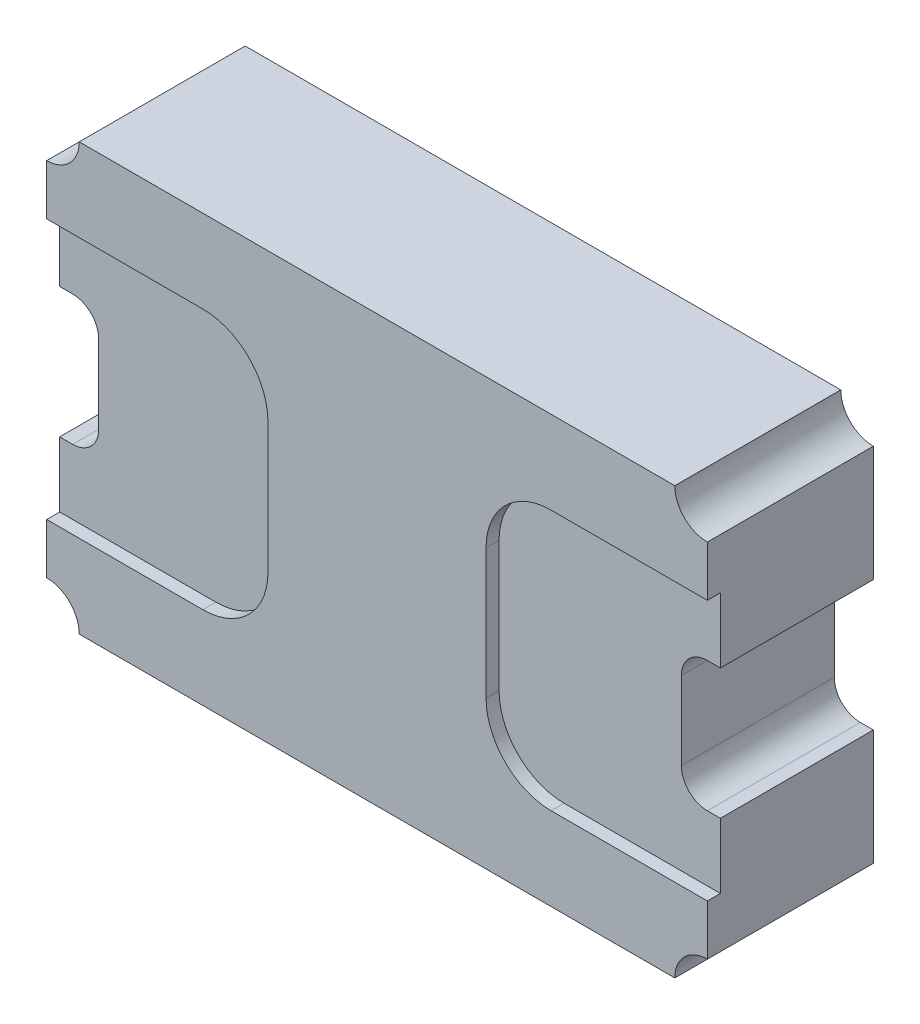
ISO-10303-21;
HEADER;
FILE_DESCRIPTION(('STEP AP214'),'2;1');
FILE_NAME('part.step','',(''),(''),'','','');
FILE_SCHEMA(('AUTOMOTIVE_DESIGN { 1 0 10303 214 1 1 1 1 }'));
ENDSEC;
DATA;
#1=APPLICATION_CONTEXT('core data for automotive mechanical design processes');
#2=APPLICATION_PROTOCOL_DEFINITION('international standard','automotive_design',2000,#1);
#3=PRODUCT_CONTEXT('',#1,'mechanical');
#4=PRODUCT('Part','Part','',(#3));
#5=PRODUCT_RELATED_PRODUCT_CATEGORY('part','',(#4));
#6=PRODUCT_DEFINITION_FORMATION('','',#4);
#7=PRODUCT_DEFINITION_CONTEXT('part definition',#1,'design');
#8=PRODUCT_DEFINITION('design','',#6,#7);
#9=PRODUCT_DEFINITION_SHAPE('','',#8);
#10=(LENGTH_UNIT() NAMED_UNIT(*) SI_UNIT(.MILLI.,.METRE.));
#11=(NAMED_UNIT(*) PLANE_ANGLE_UNIT() SI_UNIT($,.RADIAN.));
#12=(NAMED_UNIT(*) SI_UNIT($,.STERADIAN.) SOLID_ANGLE_UNIT());
#13=UNCERTAINTY_MEASURE_WITH_UNIT(LENGTH_MEASURE(1.E-05),#10,'distance_accuracy_value','');
#14=(GEOMETRIC_REPRESENTATION_CONTEXT(3) GLOBAL_UNCERTAINTY_ASSIGNED_CONTEXT((#13)) GLOBAL_UNIT_ASSIGNED_CONTEXT((#10,
#11,#12)) REPRESENTATION_CONTEXT('',''));
#15=CARTESIAN_POINT('',(0.,0.,0.));
#16=DIRECTION('',(0.,0.,1.));
#17=DIRECTION('',(1.,0.,0.));
#18=AXIS2_PLACEMENT_3D('',#15,#16,#17);
#19=CARTESIAN_POINT('',(2.5375,1.6375,1.275));
#20=DIRECTION('',(-1.,0.,0.));
#21=DIRECTION('',(0.,-1.,0.));
#22=AXIS2_PLACEMENT_3D('',#19,#20,#21);
#23=PLANE('',#22);
#24=DIRECTION('',(0.,1.,0.));
#25=VECTOR('',#24,1.);
#26=CARTESIAN_POINT('',(2.5375,1.6375,0.));
#27=LINE('',#26,#25);
#28=CARTESIAN_POINT('',(2.5375,0.499999999999999,0.));
#29=VERTEX_POINT('',#28);
#30=CARTESIAN_POINT('',(2.5375,1.3875,0.));
#31=VERTEX_POINT('',#30);
#32=EDGE_CURVE('E295',#29,#31,#27,.T.);
#33=ORIENTED_EDGE('',*,*,#32,.T.);
#34=DIRECTION('',(0.,0.,-1.));
#35=VECTOR('',#34,1.);
#36=CARTESIAN_POINT('',(2.5375,1.3875,1.7));
#37=LINE('',#36,#35);
#38=CARTESIAN_POINT('',(2.5375,1.3875,1.275));
#39=VERTEX_POINT('',#38);
#40=EDGE_CURVE('E259',#31,#39,#37,.F.);
#41=ORIENTED_EDGE('',*,*,#40,.T.);
#42=DIRECTION('',(0.,1.,0.));
#43=VECTOR('',#42,1.);
#44=CARTESIAN_POINT('',(2.5375,1.6375,1.275));
#45=LINE('',#44,#43);
#46=CARTESIAN_POINT('',(2.5375,1.,1.275));
#47=VERTEX_POINT('',#46);
#48=EDGE_CURVE('E304',#47,#39,#45,.T.);
#49=ORIENTED_EDGE('',*,*,#48,.F.);
#50=DIRECTION('',(0.,0.,1.));
#51=VECTOR('',#50,1.);
#52=CARTESIAN_POINT('',(2.5375,1.,1.275));
#53=LINE('',#52,#51);
#54=CARTESIAN_POINT('',(2.5375,1.,1.175));
#55=VERTEX_POINT('',#54);
#56=EDGE_CURVE('E579',#55,#47,#53,.T.);
#57=ORIENTED_EDGE('',*,*,#56,.F.);
#58=DIRECTION('',(0.,1.,0.));
#59=VECTOR('',#58,1.);
#60=CARTESIAN_POINT('',(2.5375,1.,1.175));
#61=LINE('',#60,#59);
#62=CARTESIAN_POINT('',(2.5375,0.499999999999999,1.175));
#63=VERTEX_POINT('',#62);
#64=EDGE_CURVE('E583',#63,#55,#61,.T.);
#65=ORIENTED_EDGE('',*,*,#64,.F.);
#66=DIRECTION('',(0.,0.,-1.));
#67=VECTOR('',#66,1.);
#68=CARTESIAN_POINT('',(2.5375,0.499999999999999,1.7));
#69=LINE('',#68,#67);
#70=EDGE_CURVE('E473',#63,#29,#69,.T.);
#71=ORIENTED_EDGE('',*,*,#70,.T.);
#72=EDGE_LOOP('',(#33,#41,#49,#57,#65,#71));
#73=FACE_BOUND('',#72,.T.);
#74=ADVANCED_FACE('F45',(#73),#23,.F.);
#75=CARTESIAN_POINT('',(-2.5375,1.6375,1.275));
#76=DIRECTION('',(1.,0.,0.));
#77=DIRECTION('',(0.,1.,0.));
#78=AXIS2_PLACEMENT_3D('',#75,#76,#77);
#79=PLANE('',#78);
#80=DIRECTION('',(0.,-1.,0.));
#81=VECTOR('',#80,1.);
#82=CARTESIAN_POINT('',(-2.5375,1.6375,1.275));
#83=LINE('',#82,#81);
#84=CARTESIAN_POINT('',(-2.5375,1.3875,1.275));
#85=VERTEX_POINT('',#84);
#86=CARTESIAN_POINT('',(-2.5375,1.,1.275));
#87=VERTEX_POINT('',#86);
#88=EDGE_CURVE('E434',#85,#87,#83,.T.);
#89=ORIENTED_EDGE('',*,*,#88,.F.);
#90=DIRECTION('',(0.,0.,-1.));
#91=VECTOR('',#90,1.);
#92=CARTESIAN_POINT('',(-2.5375,1.3875,1.7));
#93=LINE('',#92,#91);
#94=CARTESIAN_POINT('',(-2.5375,1.3875,0.));
#95=VERTEX_POINT('',#94);
#96=EDGE_CURVE('E625',#85,#95,#93,.T.);
#97=ORIENTED_EDGE('',*,*,#96,.T.);
#98=DIRECTION('',(0.,-1.,0.));
#99=VECTOR('',#98,1.);
#100=CARTESIAN_POINT('',(-2.5375,1.6375,0.));
#101=LINE('',#100,#99);
#102=CARTESIAN_POINT('',(-2.5375,0.5,0.));
#103=VERTEX_POINT('',#102);
#104=EDGE_CURVE('E292',#95,#103,#101,.T.);
#105=ORIENTED_EDGE('',*,*,#104,.T.);
#106=DIRECTION('',(0.,0.,-1.));
#107=VECTOR('',#106,1.);
#108=CARTESIAN_POINT('',(-2.5375,0.5,1.7));
#109=LINE('',#108,#107);
#110=CARTESIAN_POINT('',(-2.5375,0.5,1.175));
#111=VERTEX_POINT('',#110);
#112=EDGE_CURVE('E499',#111,#103,#109,.T.);
#113=ORIENTED_EDGE('',*,*,#112,.F.);
#114=DIRECTION('',(0.,-1.,0.));
#115=VECTOR('',#114,1.);
#116=CARTESIAN_POINT('',(-2.5375,1.,1.175));
#117=LINE('',#116,#115);
#118=CARTESIAN_POINT('',(-2.5375,1.,1.175));
#119=VERTEX_POINT('',#118);
#120=EDGE_CURVE('E560',#119,#111,#117,.T.);
#121=ORIENTED_EDGE('',*,*,#120,.F.);
#122=DIRECTION('',(0.,0.,-1.));
#123=VECTOR('',#122,1.);
#124=CARTESIAN_POINT('',(-2.5375,1.,1.275));
#125=LINE('',#124,#123);
#126=EDGE_CURVE('E492',#87,#119,#125,.T.);
#127=ORIENTED_EDGE('',*,*,#126,.F.);
#128=EDGE_LOOP('',(#89,#97,#105,#113,#121,#127));
#129=FACE_BOUND('',#128,.T.);
#130=ADVANCED_FACE('F712',(#129),#79,.F.);
#131=CARTESIAN_POINT('',(2.5375,-1.3875,1.275));
#132=VERTEX_POINT('',#131);
#133=CARTESIAN_POINT('',(2.5375,-1.,1.275));
#134=VERTEX_POINT('',#133);
#135=EDGE_CURVE('E428',#132,#134,#45,.T.);
#136=ORIENTED_EDGE('',*,*,#135,.F.);
#137=DIRECTION('',(0.,0.,-1.));
#138=VECTOR('',#137,1.);
#139=CARTESIAN_POINT('',(2.5375,-1.3875,1.7));
#140=LINE('',#139,#138);
#141=CARTESIAN_POINT('',(2.5375,-1.3875,0.));
#142=VERTEX_POINT('',#141);
#143=EDGE_CURVE('E457',#132,#142,#140,.T.);
#144=ORIENTED_EDGE('',*,*,#143,.T.);
#145=CARTESIAN_POINT('',(2.5375,-0.5,0.));
#146=VERTEX_POINT('',#145);
#147=EDGE_CURVE('E286',#142,#146,#27,.T.);
#148=ORIENTED_EDGE('',*,*,#147,.T.);
#149=DIRECTION('',(0.,0.,-1.));
#150=VECTOR('',#149,1.);
#151=CARTESIAN_POINT('',(2.5375,-0.5,1.7));
#152=LINE('',#151,#150);
#153=CARTESIAN_POINT('',(2.5375,-0.5,1.175));
#154=VERTEX_POINT('',#153);
#155=EDGE_CURVE('E527',#154,#146,#152,.T.);
#156=ORIENTED_EDGE('',*,*,#155,.F.);
#157=CARTESIAN_POINT('',(2.5375,-1.,1.175));
#158=VERTEX_POINT('',#157);
#159=EDGE_CURVE('E584',#158,#154,#61,.T.);
#160=ORIENTED_EDGE('',*,*,#159,.F.);
#161=DIRECTION('',(0.,0.,-1.));
#162=VECTOR('',#161,1.);
#163=CARTESIAN_POINT('',(2.5375,-1.,1.175));
#164=LINE('',#163,#162);
#165=EDGE_CURVE('E416',#134,#158,#164,.T.);
#166=ORIENTED_EDGE('',*,*,#165,.F.);
#167=EDGE_LOOP('',(#136,#144,#148,#156,#160,#166));
#168=FACE_BOUND('',#167,.T.);
#169=ADVANCED_FACE('F747',(#168),#23,.F.);
#170=CARTESIAN_POINT('',(-2.5375,1.6375,1.275));
#171=DIRECTION('',(0.,-1.,0.));
#172=DIRECTION('',(1.,0.,0.));
#173=AXIS2_PLACEMENT_3D('',#170,#171,#172);
#174=PLANE('',#173);
#175=DIRECTION('',(-1.,0.,0.));
#176=VECTOR('',#175,1.);
#177=CARTESIAN_POINT('',(-2.5375,1.6375,0.));
#178=LINE('',#177,#176);
#179=CARTESIAN_POINT('',(2.2875,1.6375,0.));
#180=VERTEX_POINT('',#179);
#181=CARTESIAN_POINT('',(-2.2875,1.6375,0.));
#182=VERTEX_POINT('',#181);
#183=EDGE_CURVE('E273',#180,#182,#178,.T.);
#184=ORIENTED_EDGE('',*,*,#183,.T.);
#185=DIRECTION('',(0.,0.,-1.));
#186=VECTOR('',#185,1.);
#187=CARTESIAN_POINT('',(-2.2875,1.6375,1.7));
#188=LINE('',#187,#186);
#189=CARTESIAN_POINT('',(-2.2875,1.6375,1.275));
#190=VERTEX_POINT('',#189);
#191=EDGE_CURVE('E631',#182,#190,#188,.F.);
#192=ORIENTED_EDGE('',*,*,#191,.T.);
#193=DIRECTION('',(-1.,0.,0.));
#194=VECTOR('',#193,1.);
#195=CARTESIAN_POINT('',(-2.5375,1.6375,1.275));
#196=LINE('',#195,#194);
#197=CARTESIAN_POINT('',(2.2875,1.6375,1.275));
#198=VERTEX_POINT('',#197);
#199=EDGE_CURVE('E275',#198,#190,#196,.T.);
#200=ORIENTED_EDGE('',*,*,#199,.F.);
#201=DIRECTION('',(0.,0.,-1.));
#202=VECTOR('',#201,1.);
#203=CARTESIAN_POINT('',(2.2875,1.6375,1.7));
#204=LINE('',#203,#202);
#205=EDGE_CURVE('E256',#198,#180,#204,.T.);
#206=ORIENTED_EDGE('',*,*,#205,.T.);
#207=EDGE_LOOP('',(#184,#192,#200,#206));
#208=FACE_BOUND('',#207,.T.);
#209=ADVANCED_FACE('F271',(#208),#174,.F.);
#210=CARTESIAN_POINT('',(-2.5375,-0.5,0.));
#211=VERTEX_POINT('',#210);
#212=CARTESIAN_POINT('',(-2.5375,-1.3875,0.));
#213=VERTEX_POINT('',#212);
#214=EDGE_CURVE('E285',#211,#213,#101,.T.);
#215=ORIENTED_EDGE('',*,*,#214,.T.);
#216=DIRECTION('',(0.,0.,-1.));
#217=VECTOR('',#216,1.);
#218=CARTESIAN_POINT('',(-2.5375,-1.3875,1.7));
#219=LINE('',#218,#217);
#220=CARTESIAN_POINT('',(-2.5375,-1.3875,1.275));
#221=VERTEX_POINT('',#220);
#222=EDGE_CURVE('E465',#213,#221,#219,.F.);
#223=ORIENTED_EDGE('',*,*,#222,.T.);
#224=CARTESIAN_POINT('',(-2.5375,-1.,1.275));
#225=VERTEX_POINT('',#224);
#226=EDGE_CURVE('E433',#225,#221,#83,.T.);
#227=ORIENTED_EDGE('',*,*,#226,.F.);
#228=DIRECTION('',(0.,0.,1.));
#229=VECTOR('',#228,1.);
#230=CARTESIAN_POINT('',(-2.5375,-1.,1.175));
#231=LINE('',#230,#229);
#232=CARTESIAN_POINT('',(-2.5375,-1.,1.175));
#233=VERTEX_POINT('',#232);
#234=EDGE_CURVE('E551',#233,#225,#231,.T.);
#235=ORIENTED_EDGE('',*,*,#234,.F.);
#236=CARTESIAN_POINT('',(-2.5375,-0.5,1.175));
#237=VERTEX_POINT('',#236);
#238=EDGE_CURVE('E559',#237,#233,#117,.T.);
#239=ORIENTED_EDGE('',*,*,#238,.F.);
#240=DIRECTION('',(0.,0.,-1.));
#241=VECTOR('',#240,1.);
#242=CARTESIAN_POINT('',(-2.5375,-0.5,1.7));
#243=LINE('',#242,#241);
#244=EDGE_CURVE('E503',#237,#211,#243,.T.);
#245=ORIENTED_EDGE('',*,*,#244,.T.);
#246=EDGE_LOOP('',(#215,#223,#227,#235,#239,#245));
#247=FACE_BOUND('',#246,.T.);
#248=ADVANCED_FACE('F752',(#247),#79,.F.);
#249=CARTESIAN_POINT('',(-2.5375,-1.6375,1.275));
#250=DIRECTION('',(0.,1.,0.));
#251=DIRECTION('',(0.,0.,1.));
#252=AXIS2_PLACEMENT_3D('',#249,#250,#251);
#253=PLANE('',#252);
#254=DIRECTION('',(1.,0.,0.));
#255=VECTOR('',#254,1.);
#256=CARTESIAN_POINT('',(-2.5375,-1.6375,0.));
#257=LINE('',#256,#255);
#258=CARTESIAN_POINT('',(-2.2875,-1.6375,0.));
#259=VERTEX_POINT('',#258);
#260=CARTESIAN_POINT('',(2.2875,-1.6375,0.));
#261=VERTEX_POINT('',#260);
#262=EDGE_CURVE('E300',#259,#261,#257,.T.);
#263=ORIENTED_EDGE('',*,*,#262,.T.);
#264=DIRECTION('',(0.,0.,-1.));
#265=VECTOR('',#264,1.);
#266=CARTESIAN_POINT('',(2.2875,-1.6375,1.7));
#267=LINE('',#266,#265);
#268=CARTESIAN_POINT('',(2.2875,-1.6375,1.275));
#269=VERTEX_POINT('',#268);
#270=EDGE_CURVE('E453',#261,#269,#267,.F.);
#271=ORIENTED_EDGE('',*,*,#270,.T.);
#272=DIRECTION('',(1.,0.,0.));
#273=VECTOR('',#272,1.);
#274=CARTESIAN_POINT('',(-2.5375,-1.6375,1.275));
#275=LINE('',#274,#273);
#276=CARTESIAN_POINT('',(-2.2875,-1.6375,1.275));
#277=VERTEX_POINT('',#276);
#278=EDGE_CURVE('E310',#277,#269,#275,.T.);
#279=ORIENTED_EDGE('',*,*,#278,.F.);
#280=DIRECTION('',(0.,0.,-1.));
#281=VECTOR('',#280,1.);
#282=CARTESIAN_POINT('',(-2.2875,-1.6375,1.7));
#283=LINE('',#282,#281);
#284=EDGE_CURVE('E451',#277,#259,#283,.T.);
#285=ORIENTED_EDGE('',*,*,#284,.T.);
#286=EDGE_LOOP('',(#263,#271,#279,#285));
#287=FACE_BOUND('',#286,.T.);
#288=ADVANCED_FACE('F450',(#287),#253,.F.);
#289=CARTESIAN_POINT('',(0.,0.,1.275));
#290=DIRECTION('',(0.,0.,1.));
#291=DIRECTION('',(1.,0.,0.));
#292=AXIS2_PLACEMENT_3D('',#289,#290,#291);
#293=PLANE('',#292);
#294=CARTESIAN_POINT('',(2.5375,-1.6375,1.275));
#295=DIRECTION('',(0.,0.,1.));
#296=DIRECTION('',(1.,0.,0.));
#297=AXIS2_PLACEMENT_3D('',#294,#295,#296);
#298=CIRCLE('',#297,0.25);
#299=EDGE_CURVE('E443',#132,#269,#298,.T.);
#300=ORIENTED_EDGE('',*,*,#299,.F.);
#301=ORIENTED_EDGE('',*,*,#135,.T.);
#302=DIRECTION('',(1.,0.,0.));
#303=VECTOR('',#302,1.);
#304=CARTESIAN_POINT('',(0.837500000000001,-1.,1.275));
#305=LINE('',#304,#303);
#306=CARTESIAN_POINT('',(1.3375,-1.,1.275));
#307=VERTEX_POINT('',#306);
#308=EDGE_CURVE('E397',#307,#134,#305,.T.);
#309=ORIENTED_EDGE('',*,*,#308,.F.);
#310=CARTESIAN_POINT('',(1.3375,-0.5,1.275));
#311=DIRECTION('',(0.,0.,1.));
#312=DIRECTION('',(1.,0.,0.));
#313=AXIS2_PLACEMENT_3D('',#310,#311,#312);
#314=CIRCLE('',#313,0.5);
#315=CARTESIAN_POINT('',(0.837500000000001,-0.5,1.275));
#316=VERTEX_POINT('',#315);
#317=EDGE_CURVE('E54',#307,#316,#314,.F.);
#318=ORIENTED_EDGE('',*,*,#317,.T.);
#319=DIRECTION('',(0.,-1.,0.));
#320=VECTOR('',#319,1.);
#321=CARTESIAN_POINT('',(0.837500000000001,1.,1.275));
#322=LINE('',#321,#320);
#323=CARTESIAN_POINT('',(0.837500000000001,0.5,1.275));
#324=VERTEX_POINT('',#323);
#325=EDGE_CURVE('E395',#324,#316,#322,.T.);
#326=ORIENTED_EDGE('',*,*,#325,.F.);
#327=CARTESIAN_POINT('',(1.3375,0.5,1.275));
#328=DIRECTION('',(0.,0.,1.));
#329=DIRECTION('',(1.,0.,0.));
#330=AXIS2_PLACEMENT_3D('',#327,#328,#329);
#331=CIRCLE('',#330,0.5);
#332=CARTESIAN_POINT('',(1.3375,1.,1.275));
#333=VERTEX_POINT('',#332);
#334=EDGE_CURVE('E11',#324,#333,#331,.F.);
#335=ORIENTED_EDGE('',*,*,#334,.T.);
#336=DIRECTION('',(1.,0.,0.));
#337=VECTOR('',#336,1.);
#338=CARTESIAN_POINT('',(0.837500000000001,1.,1.275));
#339=LINE('',#338,#337);
#340=EDGE_CURVE('E424',#333,#47,#339,.T.);
#341=ORIENTED_EDGE('',*,*,#340,.T.);
#342=ORIENTED_EDGE('',*,*,#48,.T.);
#343=CARTESIAN_POINT('',(2.5375,1.6375,1.275));
#344=DIRECTION('',(0.,0.,1.));
#345=DIRECTION('',(1.,0.,0.));
#346=AXIS2_PLACEMENT_3D('',#343,#344,#345);
#347=CIRCLE('',#346,0.25);
#348=EDGE_CURVE('E277',#198,#39,#347,.T.);
#349=ORIENTED_EDGE('',*,*,#348,.F.);
#350=ORIENTED_EDGE('',*,*,#199,.T.);
#351=CARTESIAN_POINT('',(-2.5375,1.6375,1.275));
#352=DIRECTION('',(0.,0.,1.));
#353=DIRECTION('',(1.,0.,0.));
#354=AXIS2_PLACEMENT_3D('',#351,#352,#353);
#355=CIRCLE('',#354,0.25);
#356=EDGE_CURVE('E629',#85,#190,#355,.T.);
#357=ORIENTED_EDGE('',*,*,#356,.F.);
#358=ORIENTED_EDGE('',*,*,#88,.T.);
#359=DIRECTION('',(-1.,0.,0.));
#360=VECTOR('',#359,1.);
#361=CARTESIAN_POINT('',(-0.8375,1.,1.275));
#362=LINE('',#361,#360);
#363=CARTESIAN_POINT('',(-1.3375,1.,1.275));
#364=VERTEX_POINT('',#363);
#365=EDGE_CURVE('E567',#364,#87,#362,.T.);
#366=ORIENTED_EDGE('',*,*,#365,.F.);
#367=CARTESIAN_POINT('',(-1.3375,0.5,1.275));
#368=DIRECTION('',(0.,0.,1.));
#369=DIRECTION('',(1.,0.,0.));
#370=AXIS2_PLACEMENT_3D('',#367,#368,#369);
#371=CIRCLE('',#370,0.5);
#372=CARTESIAN_POINT('',(-0.8375,0.5,1.275));
#373=VERTEX_POINT('',#372);
#374=EDGE_CURVE('E383',#364,#373,#371,.F.);
#375=ORIENTED_EDGE('',*,*,#374,.T.);
#376=DIRECTION('',(0.,1.,0.));
#377=VECTOR('',#376,1.);
#378=CARTESIAN_POINT('',(-0.8375,-1.,1.275));
#379=LINE('',#378,#377);
#380=CARTESIAN_POINT('',(-0.8375,-0.5,1.275));
#381=VERTEX_POINT('',#380);
#382=EDGE_CURVE('E550',#381,#373,#379,.T.);
#383=ORIENTED_EDGE('',*,*,#382,.F.);
#384=CARTESIAN_POINT('',(-1.3375,-0.5,1.275));
#385=DIRECTION('',(0.,0.,1.));
#386=DIRECTION('',(1.,0.,0.));
#387=AXIS2_PLACEMENT_3D('',#384,#385,#386);
#388=CIRCLE('',#387,0.5);
#389=CARTESIAN_POINT('',(-1.3375,-1.,1.275));
#390=VERTEX_POINT('',#389);
#391=EDGE_CURVE('E386',#381,#390,#388,.F.);
#392=ORIENTED_EDGE('',*,*,#391,.T.);
#393=DIRECTION('',(-1.,0.,0.));
#394=VECTOR('',#393,1.);
#395=CARTESIAN_POINT('',(-0.8375,-1.,1.275));
#396=LINE('',#395,#394);
#397=EDGE_CURVE('E570',#390,#225,#396,.T.);
#398=ORIENTED_EDGE('',*,*,#397,.T.);
#399=ORIENTED_EDGE('',*,*,#226,.T.);
#400=CARTESIAN_POINT('',(-2.5375,-1.6375,1.275));
#401=DIRECTION('',(0.,0.,1.));
#402=DIRECTION('',(1.,0.,0.));
#403=AXIS2_PLACEMENT_3D('',#400,#401,#402);
#404=CIRCLE('',#403,0.25);
#405=EDGE_CURVE('E446',#277,#221,#404,.T.);
#406=ORIENTED_EDGE('',*,*,#405,.F.);
#407=ORIENTED_EDGE('',*,*,#278,.T.);
#408=EDGE_LOOP('',(#300,#301,#309,#318,#326,#335,#341,#342,#349,#350,#357,#358,#366,#375,#383,
#392,#398,#399,#406,#407));
#409=FACE_BOUND('',#408,.T.);
#410=ADVANCED_FACE('F394',(#409),#293,.T.);
#411=CARTESIAN_POINT('',(0.,0.,0.));
#412=DIRECTION('',(0.,0.,1.));
#413=DIRECTION('',(1.,0.,0.));
#414=AXIS2_PLACEMENT_3D('',#411,#412,#413);
#415=PLANE('',#414);
#416=ORIENTED_EDGE('',*,*,#147,.F.);
#417=CARTESIAN_POINT('',(2.5375,-1.6375,0.));
#418=DIRECTION('',(0.,0.,-1.));
#419=DIRECTION('',(-1.,0.,0.));
#420=AXIS2_PLACEMENT_3D('',#417,#418,#419);
#421=CIRCLE('',#420,0.25);
#422=EDGE_CURVE('E701',#261,#142,#421,.T.);
#423=ORIENTED_EDGE('',*,*,#422,.F.);
#424=ORIENTED_EDGE('',*,*,#262,.F.);
#425=CARTESIAN_POINT('',(-2.5375,-1.6375,0.));
#426=DIRECTION('',(0.,0.,-1.));
#427=DIRECTION('',(-1.,0.,0.));
#428=AXIS2_PLACEMENT_3D('',#425,#426,#427);
#429=CIRCLE('',#428,0.25);
#430=EDGE_CURVE('E669',#213,#259,#429,.T.);
#431=ORIENTED_EDGE('',*,*,#430,.F.);
#432=ORIENTED_EDGE('',*,*,#214,.F.);
#433=DIRECTION('',(-1.,0.,0.));
#434=VECTOR('',#433,1.);
#435=CARTESIAN_POINT('',(-2.5375,-0.5,0.));
#436=LINE('',#435,#434);
#437=CARTESIAN_POINT('',(-2.4375,-0.5,0.));
#438=VERTEX_POINT('',#437);
#439=EDGE_CURVE('E472',#438,#211,#436,.T.);
#440=ORIENTED_EDGE('',*,*,#439,.F.);
#441=CARTESIAN_POINT('',(-2.4375,-0.3,0.));
#442=DIRECTION('',(0.,0.,-1.));
#443=DIRECTION('',(-1.,0.,0.));
#444=AXIS2_PLACEMENT_3D('',#441,#442,#443);
#445=CIRCLE('',#444,0.2);
#446=CARTESIAN_POINT('',(-2.2375,-0.299999999999999,0.));
#447=VERTEX_POINT('',#446);
#448=EDGE_CURVE('E469',#447,#438,#445,.T.);
#449=ORIENTED_EDGE('',*,*,#448,.F.);
#450=DIRECTION('',(0.,-1.,0.));
#451=VECTOR('',#450,1.);
#452=CARTESIAN_POINT('',(-2.2375,-0.299999999999999,0.));
#453=LINE('',#452,#451);
#454=CARTESIAN_POINT('',(-2.2375,0.299999999999999,0.));
#455=VERTEX_POINT('',#454);
#456=EDGE_CURVE('E484',#455,#447,#453,.T.);
#457=ORIENTED_EDGE('',*,*,#456,.F.);
#458=CARTESIAN_POINT('',(-2.4375,0.3,0.));
#459=DIRECTION('',(0.,0.,-1.));
#460=DIRECTION('',(1.,0.,0.));
#461=AXIS2_PLACEMENT_3D('',#458,#459,#460);
#462=CIRCLE('',#461,0.2);
#463=CARTESIAN_POINT('',(-2.4375,0.5,0.));
#464=VERTEX_POINT('',#463);
#465=EDGE_CURVE('E480',#464,#455,#462,.T.);
#466=ORIENTED_EDGE('',*,*,#465,.F.);
#467=DIRECTION('',(1.,0.,0.));
#468=VECTOR('',#467,1.);
#469=CARTESIAN_POINT('',(-2.4375,0.5,0.));
#470=LINE('',#469,#468);
#471=EDGE_CURVE('E476',#103,#464,#470,.T.);
#472=ORIENTED_EDGE('',*,*,#471,.F.);
#473=ORIENTED_EDGE('',*,*,#104,.F.);
#474=CARTESIAN_POINT('',(-2.5375,1.6375,0.));
#475=DIRECTION('',(0.,0.,-1.));
#476=DIRECTION('',(-1.,0.,0.));
#477=AXIS2_PLACEMENT_3D('',#474,#475,#476);
#478=CIRCLE('',#477,0.25);
#479=EDGE_CURVE('E283',#182,#95,#478,.T.);
#480=ORIENTED_EDGE('',*,*,#479,.F.);
#481=ORIENTED_EDGE('',*,*,#183,.F.);
#482=CARTESIAN_POINT('',(2.5375,1.6375,0.));
#483=DIRECTION('',(0.,0.,1.));
#484=DIRECTION('',(1.,0.,0.));
#485=AXIS2_PLACEMENT_3D('',#482,#483,#484);
#486=CIRCLE('',#485,0.25);
#487=EDGE_CURVE('E253',#180,#31,#486,.T.);
#488=ORIENTED_EDGE('',*,*,#487,.T.);
#489=ORIENTED_EDGE('',*,*,#32,.F.);
#490=DIRECTION('',(1.,0.,0.));
#491=VECTOR('',#490,1.);
#492=CARTESIAN_POINT('',(2.4375,0.5,0.));
#493=LINE('',#492,#491);
#494=CARTESIAN_POINT('',(2.4375,0.5,0.));
#495=VERTEX_POINT('',#494);
#496=EDGE_CURVE('E524',#495,#29,#493,.T.);
#497=ORIENTED_EDGE('',*,*,#496,.F.);
#498=CARTESIAN_POINT('',(2.4375,0.3,0.));
#499=DIRECTION('',(0.,0.,-1.));
#500=DIRECTION('',(-1.,0.,0.));
#501=AXIS2_PLACEMENT_3D('',#498,#499,#500);
#502=CIRCLE('',#501,0.2);
#503=CARTESIAN_POINT('',(2.2375,0.299999999999998,0.));
#504=VERTEX_POINT('',#503);
#505=EDGE_CURVE('E520',#504,#495,#502,.T.);
#506=ORIENTED_EDGE('',*,*,#505,.F.);
#507=DIRECTION('',(0.,1.,0.));
#508=VECTOR('',#507,1.);
#509=CARTESIAN_POINT('',(2.2375,-0.299999999999999,0.));
#510=LINE('',#509,#508);
#511=CARTESIAN_POINT('',(2.2375,-0.299999999999999,0.));
#512=VERTEX_POINT('',#511);
#513=EDGE_CURVE('E516',#512,#504,#510,.T.);
#514=ORIENTED_EDGE('',*,*,#513,.F.);
#515=CARTESIAN_POINT('',(2.4375,-0.3,0.));
#516=DIRECTION('',(0.,0.,-1.));
#517=DIRECTION('',(1.,0.,0.));
#518=AXIS2_PLACEMENT_3D('',#515,#516,#517);
#519=CIRCLE('',#518,0.2);
#520=CARTESIAN_POINT('',(2.4375,-0.5,0.));
#521=VERTEX_POINT('',#520);
#522=EDGE_CURVE('E512',#521,#512,#519,.T.);
#523=ORIENTED_EDGE('',*,*,#522,.F.);
#524=DIRECTION('',(-1.,0.,0.));
#525=VECTOR('',#524,1.);
#526=CARTESIAN_POINT('',(2.4375,-0.5,0.));
#527=LINE('',#526,#525);
#528=EDGE_CURVE('E462',#146,#521,#527,.T.);
#529=ORIENTED_EDGE('',*,*,#528,.F.);
#530=EDGE_LOOP('',(#416,#423,#424,#431,#432,#440,#449,#457,#466,#472,#473,#480,#481,#488,#489,
#497,#506,#514,#523,#529));
#531=FACE_BOUND('',#530,.T.);
#532=ADVANCED_FACE('F281',(#531),#415,.F.);
#533=CARTESIAN_POINT('',(0.837500000000001,-1.,1.175));
#534=DIRECTION('',(0.,-1.,0.));
#535=DIRECTION('',(1.,0.,0.));
#536=AXIS2_PLACEMENT_3D('',#533,#534,#535);
#537=PLANE('',#536);
#538=DIRECTION('',(1.,0.,0.));
#539=VECTOR('',#538,1.);
#540=CARTESIAN_POINT('',(0.837500000000001,-1.,1.175));
#541=LINE('',#540,#539);
#542=CARTESIAN_POINT('',(1.3375,-1.,1.175));
#543=VERTEX_POINT('',#542);
#544=EDGE_CURVE('E406',#543,#158,#541,.T.);
#545=ORIENTED_EDGE('',*,*,#544,.F.);
#546=DIRECTION('',(0.,0.,-1.));
#547=VECTOR('',#546,1.);
#548=CARTESIAN_POINT('',(1.3375,-1.,1.175));
#549=LINE('',#548,#547);
#550=EDGE_CURVE('E67',#543,#307,#549,.F.);
#551=ORIENTED_EDGE('',*,*,#550,.T.);
#552=ORIENTED_EDGE('',*,*,#308,.T.);
#553=ORIENTED_EDGE('',*,*,#165,.T.);
#554=EDGE_LOOP('',(#545,#551,#552,#553));
#555=FACE_BOUND('',#554,.T.);
#556=ADVANCED_FACE('F414',(#555),#537,.F.);
#557=CARTESIAN_POINT('',(0.837500000000001,1.,1.275));
#558=DIRECTION('',(0.,1.,0.));
#559=DIRECTION('',(-1.,0.,0.));
#560=AXIS2_PLACEMENT_3D('',#557,#558,#559);
#561=PLANE('',#560);
#562=ORIENTED_EDGE('',*,*,#340,.F.);
#563=DIRECTION('',(0.,0.,1.));
#564=VECTOR('',#563,1.);
#565=CARTESIAN_POINT('',(1.3375,1.,1.275));
#566=LINE('',#565,#564);
#567=CARTESIAN_POINT('',(1.3375,1.,1.175));
#568=VERTEX_POINT('',#567);
#569=EDGE_CURVE('E380',#333,#568,#566,.F.);
#570=ORIENTED_EDGE('',*,*,#569,.T.);
#571=DIRECTION('',(1.,0.,0.));
#572=VECTOR('',#571,1.);
#573=CARTESIAN_POINT('',(0.837500000000001,1.,1.175));
#574=LINE('',#573,#572);
#575=EDGE_CURVE('E419',#568,#55,#574,.T.);
#576=ORIENTED_EDGE('',*,*,#575,.T.);
#577=ORIENTED_EDGE('',*,*,#56,.T.);
#578=EDGE_LOOP('',(#562,#570,#576,#577));
#579=FACE_BOUND('',#578,.T.);
#580=ADVANCED_FACE('F598',(#579),#561,.F.);
#581=CARTESIAN_POINT('',(0.837500000000001,1.,1.175));
#582=DIRECTION('',(0.,0.,-1.));
#583=DIRECTION('',(0.,1.,0.));
#584=AXIS2_PLACEMENT_3D('',#581,#582,#583);
#585=PLANE('',#584);
#586=DIRECTION('',(0.,1.,0.));
#587=VECTOR('',#586,1.);
#588=CARTESIAN_POINT('',(0.837500000000001,1.,1.175));
#589=LINE('',#588,#587);
#590=CARTESIAN_POINT('',(0.837500000000001,-0.5,1.175));
#591=VERTEX_POINT('',#590);
#592=CARTESIAN_POINT('',(0.837500000000001,0.5,1.175));
#593=VERTEX_POINT('',#592);
#594=EDGE_CURVE('E407',#591,#593,#589,.T.);
#595=ORIENTED_EDGE('',*,*,#594,.F.);
#596=CARTESIAN_POINT('',(1.3375,-0.5,1.175));
#597=DIRECTION('',(0.,0.,-1.));
#598=DIRECTION('',(0.,1.,0.));
#599=AXIS2_PLACEMENT_3D('',#596,#597,#598);
#600=CIRCLE('',#599,0.5);
#601=EDGE_CURVE('E375',#591,#543,#600,.F.);
#602=ORIENTED_EDGE('',*,*,#601,.T.);
#603=ORIENTED_EDGE('',*,*,#544,.T.);
#604=ORIENTED_EDGE('',*,*,#159,.T.);
#605=DIRECTION('',(-1.,0.,0.));
#606=VECTOR('',#605,1.);
#607=CARTESIAN_POINT('',(0.837499999999999,-0.499999999999999,1.175));
#608=LINE('',#607,#606);
#609=CARTESIAN_POINT('',(2.4375,-0.5,1.175));
#610=VERTEX_POINT('',#609);
#611=EDGE_CURVE('E326',#154,#610,#608,.T.);
#612=ORIENTED_EDGE('',*,*,#611,.T.);
#613=CARTESIAN_POINT('',(2.4375,-0.3,1.175));
#614=DIRECTION('',(0.,0.,-1.));
#615=DIRECTION('',(0.,1.,0.));
#616=AXIS2_PLACEMENT_3D('',#613,#614,#615);
#617=CIRCLE('',#616,0.2);
#618=CARTESIAN_POINT('',(2.2375,-0.299999999999999,1.175));
#619=VERTEX_POINT('',#618);
#620=EDGE_CURVE('E330',#610,#619,#617,.T.);
#621=ORIENTED_EDGE('',*,*,#620,.T.);
#622=DIRECTION('',(0.,1.,0.));
#623=VECTOR('',#622,1.);
#624=CARTESIAN_POINT('',(2.2375,1.,1.175));
#625=LINE('',#624,#623);
#626=CARTESIAN_POINT('',(2.2375,0.299999999999998,1.175));
#627=VERTEX_POINT('',#626);
#628=EDGE_CURVE('E334',#619,#627,#625,.T.);
#629=ORIENTED_EDGE('',*,*,#628,.T.);
#630=CARTESIAN_POINT('',(2.4375,0.3,1.175));
#631=DIRECTION('',(0.,0.,-1.));
#632=DIRECTION('',(0.,1.,0.));
#633=AXIS2_PLACEMENT_3D('',#630,#631,#632);
#634=CIRCLE('',#633,0.2);
#635=CARTESIAN_POINT('',(2.4375,0.5,1.175));
#636=VERTEX_POINT('',#635);
#637=EDGE_CURVE('E338',#627,#636,#634,.T.);
#638=ORIENTED_EDGE('',*,*,#637,.T.);
#639=DIRECTION('',(1.,0.,0.));
#640=VECTOR('',#639,1.);
#641=CARTESIAN_POINT('',(0.8375,0.500000000000003,1.175));
#642=LINE('',#641,#640);
#643=EDGE_CURVE('E266',#636,#63,#642,.T.);
#644=ORIENTED_EDGE('',*,*,#643,.T.);
#645=ORIENTED_EDGE('',*,*,#64,.T.);
#646=ORIENTED_EDGE('',*,*,#575,.F.);
#647=CARTESIAN_POINT('',(1.3375,0.5,1.175));
#648=DIRECTION('',(0.,0.,-1.));
#649=DIRECTION('',(0.,1.,0.));
#650=AXIS2_PLACEMENT_3D('',#647,#648,#649);
#651=CIRCLE('',#650,0.5);
#652=EDGE_CURVE('E372',#568,#593,#651,.F.);
#653=ORIENTED_EDGE('',*,*,#652,.T.);
#654=EDGE_LOOP('',(#595,#602,#603,#604,#612,#621,#629,#638,#644,#645,#646,#653));
#655=FACE_BOUND('',#654,.T.);
#656=ADVANCED_FACE('F411',(#655),#585,.F.);
#657=CARTESIAN_POINT('',(0.837500000000001,0.,0.));
#658=DIRECTION('',(1.,0.,0.));
#659=DIRECTION('',(0.,0.,-1.));
#660=AXIS2_PLACEMENT_3D('',#657,#658,#659);
#661=PLANE('',#660);
#662=ORIENTED_EDGE('',*,*,#325,.T.);
#663=DIRECTION('',(0.,0.,-1.));
#664=VECTOR('',#663,1.);
#665=CARTESIAN_POINT('',(0.837500000000001,-0.5,0.));
#666=LINE('',#665,#664);
#667=EDGE_CURVE('E368',#316,#591,#666,.T.);
#668=ORIENTED_EDGE('',*,*,#667,.T.);
#669=ORIENTED_EDGE('',*,*,#594,.T.);
#670=DIRECTION('',(0.,0.,1.));
#671=VECTOR('',#670,1.);
#672=CARTESIAN_POINT('',(0.837500000000001,0.5,0.));
#673=LINE('',#672,#671);
#674=EDGE_CURVE('E364',#593,#324,#673,.T.);
#675=ORIENTED_EDGE('',*,*,#674,.T.);
#676=EDGE_LOOP('',(#662,#668,#669,#675));
#677=FACE_BOUND('',#676,.T.);
#678=ADVANCED_FACE('F401',(#677),#661,.T.);
#679=CARTESIAN_POINT('',(-0.8375,1.,1.275));
#680=DIRECTION('',(0.,1.,0.));
#681=DIRECTION('',(0.,0.,1.));
#682=AXIS2_PLACEMENT_3D('',#679,#680,#681);
#683=PLANE('',#682);
#684=DIRECTION('',(-1.,0.,0.));
#685=VECTOR('',#684,1.);
#686=CARTESIAN_POINT('',(-0.8375,1.,1.175));
#687=LINE('',#686,#685);
#688=CARTESIAN_POINT('',(-1.3375,1.,1.175));
#689=VERTEX_POINT('',#688);
#690=EDGE_CURVE('E555',#689,#119,#687,.T.);
#691=ORIENTED_EDGE('',*,*,#690,.F.);
#692=DIRECTION('',(0.,0.,-1.));
#693=VECTOR('',#692,1.);
#694=CARTESIAN_POINT('',(-1.3375,1.,1.275));
#695=LINE('',#694,#693);
#696=EDGE_CURVE('E358',#689,#364,#695,.F.);
#697=ORIENTED_EDGE('',*,*,#696,.T.);
#698=ORIENTED_EDGE('',*,*,#365,.T.);
#699=ORIENTED_EDGE('',*,*,#126,.T.);
#700=EDGE_LOOP('',(#691,#697,#698,#699));
#701=FACE_BOUND('',#700,.T.);
#702=ADVANCED_FACE('F730',(#701),#683,.F.);
#703=CARTESIAN_POINT('',(-0.8375,-1.,1.175));
#704=DIRECTION('',(0.,-1.,0.));
#705=DIRECTION('',(0.,0.,-1.));
#706=AXIS2_PLACEMENT_3D('',#703,#704,#705);
#707=PLANE('',#706);
#708=ORIENTED_EDGE('',*,*,#397,.F.);
#709=DIRECTION('',(0.,0.,1.));
#710=VECTOR('',#709,1.);
#711=CARTESIAN_POINT('',(-1.3375,-1.,1.175));
#712=LINE('',#711,#710);
#713=CARTESIAN_POINT('',(-1.3375,-1.,1.175));
#714=VERTEX_POINT('',#713);
#715=EDGE_CURVE('E361',#390,#714,#712,.F.);
#716=ORIENTED_EDGE('',*,*,#715,.T.);
#717=DIRECTION('',(-1.,0.,0.));
#718=VECTOR('',#717,1.);
#719=CARTESIAN_POINT('',(-0.8375,-1.,1.175));
#720=LINE('',#719,#718);
#721=EDGE_CURVE('E573',#714,#233,#720,.T.);
#722=ORIENTED_EDGE('',*,*,#721,.T.);
#723=ORIENTED_EDGE('',*,*,#234,.T.);
#724=EDGE_LOOP('',(#708,#716,#722,#723));
#725=FACE_BOUND('',#724,.T.);
#726=ADVANCED_FACE('F820',(#725),#707,.F.);
#727=CARTESIAN_POINT('',(-0.8375,1.,1.175));
#728=DIRECTION('',(0.,0.,-1.));
#729=DIRECTION('',(-1.,0.,0.));
#730=AXIS2_PLACEMENT_3D('',#727,#728,#729);
#731=PLANE('',#730);
#732=DIRECTION('',(0.,-1.,0.));
#733=VECTOR('',#732,1.);
#734=CARTESIAN_POINT('',(-0.8375,1.,1.175));
#735=LINE('',#734,#733);
#736=CARTESIAN_POINT('',(-0.8375,0.5,1.175));
#737=VERTEX_POINT('',#736);
#738=CARTESIAN_POINT('',(-0.8375,-0.5,1.175));
#739=VERTEX_POINT('',#738);
#740=EDGE_CURVE('E546',#737,#739,#735,.T.);
#741=ORIENTED_EDGE('',*,*,#740,.F.);
#742=CARTESIAN_POINT('',(-1.3375,0.5,1.175));
#743=DIRECTION('',(0.,0.,-1.));
#744=DIRECTION('',(-1.,0.,0.));
#745=AXIS2_PLACEMENT_3D('',#742,#743,#744);
#746=CIRCLE('',#745,0.5);
#747=EDGE_CURVE('E355',#737,#689,#746,.F.);
#748=ORIENTED_EDGE('',*,*,#747,.T.);
#749=ORIENTED_EDGE('',*,*,#690,.T.);
#750=ORIENTED_EDGE('',*,*,#120,.T.);
#751=DIRECTION('',(1.,0.,0.));
#752=VECTOR('',#751,1.);
#753=CARTESIAN_POINT('',(-0.8375,0.5,1.175));
#754=LINE('',#753,#752);
#755=CARTESIAN_POINT('',(-2.4375,0.5,1.175));
#756=VERTEX_POINT('',#755);
#757=EDGE_CURVE('E322',#111,#756,#754,.T.);
#758=ORIENTED_EDGE('',*,*,#757,.T.);
#759=CARTESIAN_POINT('',(-2.4375,0.3,1.175));
#760=DIRECTION('',(0.,0.,-1.));
#761=DIRECTION('',(-1.,0.,0.));
#762=AXIS2_PLACEMENT_3D('',#759,#760,#761);
#763=CIRCLE('',#762,0.2);
#764=CARTESIAN_POINT('',(-2.2375,0.299999999999999,1.175));
#765=VERTEX_POINT('',#764);
#766=EDGE_CURVE('E318',#756,#765,#763,.T.);
#767=ORIENTED_EDGE('',*,*,#766,.T.);
#768=DIRECTION('',(0.,-1.,0.));
#769=VECTOR('',#768,1.);
#770=CARTESIAN_POINT('',(-2.2375,1.,1.175));
#771=LINE('',#770,#769);
#772=CARTESIAN_POINT('',(-2.2375,-0.299999999999999,1.175));
#773=VERTEX_POINT('',#772);
#774=EDGE_CURVE('E314',#765,#773,#771,.T.);
#775=ORIENTED_EDGE('',*,*,#774,.T.);
#776=CARTESIAN_POINT('',(-2.4375,-0.3,1.175));
#777=DIRECTION('',(0.,0.,-1.));
#778=DIRECTION('',(-1.,0.,0.));
#779=AXIS2_PLACEMENT_3D('',#776,#777,#778);
#780=CIRCLE('',#779,0.2);
#781=CARTESIAN_POINT('',(-2.4375,-0.5,1.175));
#782=VERTEX_POINT('',#781);
#783=EDGE_CURVE('E309',#773,#782,#780,.T.);
#784=ORIENTED_EDGE('',*,*,#783,.T.);
#785=DIRECTION('',(-1.,0.,0.));
#786=VECTOR('',#785,1.);
#787=CARTESIAN_POINT('',(-0.8375,-0.5,1.175));
#788=LINE('',#787,#786);
#789=EDGE_CURVE('E305',#782,#237,#788,.T.);
#790=ORIENTED_EDGE('',*,*,#789,.T.);
#791=ORIENTED_EDGE('',*,*,#238,.T.);
#792=ORIENTED_EDGE('',*,*,#721,.F.);
#793=CARTESIAN_POINT('',(-1.3375,-0.5,1.175));
#794=DIRECTION('',(0.,0.,-1.));
#795=DIRECTION('',(-1.,0.,0.));
#796=AXIS2_PLACEMENT_3D('',#793,#794,#795);
#797=CIRCLE('',#796,0.5);
#798=EDGE_CURVE('E352',#714,#739,#797,.F.);
#799=ORIENTED_EDGE('',*,*,#798,.T.);
#800=EDGE_LOOP('',(#741,#748,#749,#750,#758,#767,#775,#784,#790,#791,#792,#799));
#801=FACE_BOUND('',#800,.T.);
#802=ADVANCED_FACE('F726',(#801),#731,.F.);
#803=CARTESIAN_POINT('',(-0.8375,0.,0.));
#804=DIRECTION('',(-1.,0.,0.));
#805=DIRECTION('',(0.,0.,1.));
#806=AXIS2_PLACEMENT_3D('',#803,#804,#805);
#807=PLANE('',#806);
#808=ORIENTED_EDGE('',*,*,#382,.T.);
#809=DIRECTION('',(0.,0.,-1.));
#810=VECTOR('',#809,1.);
#811=CARTESIAN_POINT('',(-0.8375,0.499999999999995,0.));
#812=LINE('',#811,#810);
#813=EDGE_CURVE('E348',#373,#737,#812,.T.);
#814=ORIENTED_EDGE('',*,*,#813,.T.);
#815=ORIENTED_EDGE('',*,*,#740,.T.);
#816=DIRECTION('',(0.,0.,1.));
#817=VECTOR('',#816,1.);
#818=CARTESIAN_POINT('',(-0.8375,-0.500000000000005,0.));
#819=LINE('',#818,#817);
#820=EDGE_CURVE('E265',#739,#381,#819,.T.);
#821=ORIENTED_EDGE('',*,*,#820,.T.);
#822=EDGE_LOOP('',(#808,#814,#815,#821));
#823=FACE_BOUND('',#822,.T.);
#824=ADVANCED_FACE('F805',(#823),#807,.T.);
#825=CARTESIAN_POINT('',(-2.4375,-0.3,1.7));
#826=DIRECTION('',(0.,0.,-1.));
#827=DIRECTION('',(-1.,0.,0.));
#828=AXIS2_PLACEMENT_3D('',#825,#826,#827);
#829=CYLINDRICAL_SURFACE('',#828,0.2);
#830=DIRECTION('',(0.,0.,-1.));
#831=VECTOR('',#830,1.);
#832=CARTESIAN_POINT('',(-2.2375,-0.299999999999999,1.7));
#833=LINE('',#832,#831);
#834=EDGE_CURVE('E489',#773,#447,#833,.T.);
#835=ORIENTED_EDGE('',*,*,#834,.T.);
#836=ORIENTED_EDGE('',*,*,#448,.T.);
#837=DIRECTION('',(0.,0.,-1.));
#838=VECTOR('',#837,1.);
#839=CARTESIAN_POINT('',(-2.4375,-0.5,1.7));
#840=LINE('',#839,#838);
#841=EDGE_CURVE('E488',#782,#438,#840,.T.);
#842=ORIENTED_EDGE('',*,*,#841,.F.);
#843=ORIENTED_EDGE('',*,*,#783,.F.);
#844=EDGE_LOOP('',(#835,#836,#842,#843));
#845=FACE_BOUND('',#844,.T.);
#846=ADVANCED_FACE('F792',(#845),#829,.F.);
#847=CARTESIAN_POINT('',(-2.2375,-0.299999999999999,1.7));
#848=DIRECTION('',(1.,0.,0.));
#849=DIRECTION('',(0.,0.,-1.));
#850=AXIS2_PLACEMENT_3D('',#847,#848,#849);
#851=PLANE('',#850);
#852=DIRECTION('',(0.,0.,-1.));
#853=VECTOR('',#852,1.);
#854=CARTESIAN_POINT('',(-2.2375,0.299999999999999,1.7));
#855=LINE('',#854,#853);
#856=EDGE_CURVE('E493',#765,#455,#855,.T.);
#857=ORIENTED_EDGE('',*,*,#856,.T.);
#858=ORIENTED_EDGE('',*,*,#456,.T.);
#859=ORIENTED_EDGE('',*,*,#834,.F.);
#860=ORIENTED_EDGE('',*,*,#774,.F.);
#861=EDGE_LOOP('',(#857,#858,#859,#860));
#862=FACE_BOUND('',#861,.T.);
#863=ADVANCED_FACE('F788',(#862),#851,.F.);
#864=CARTESIAN_POINT('',(-2.4375,0.3,1.7));
#865=DIRECTION('',(0.,0.,-1.));
#866=DIRECTION('',(-1.,0.,0.));
#867=AXIS2_PLACEMENT_3D('',#864,#865,#866);
#868=CYLINDRICAL_SURFACE('',#867,0.2);
#869=DIRECTION('',(0.,0.,-1.));
#870=VECTOR('',#869,1.);
#871=CARTESIAN_POINT('',(-2.4375,0.5,1.7));
#872=LINE('',#871,#870);
#873=EDGE_CURVE('E496',#756,#464,#872,.T.);
#874=ORIENTED_EDGE('',*,*,#873,.T.);
#875=ORIENTED_EDGE('',*,*,#465,.T.);
#876=ORIENTED_EDGE('',*,*,#856,.F.);
#877=ORIENTED_EDGE('',*,*,#766,.F.);
#878=EDGE_LOOP('',(#874,#875,#876,#877));
#879=FACE_BOUND('',#878,.T.);
#880=ADVANCED_FACE('F791',(#879),#868,.F.);
#881=CARTESIAN_POINT('',(-2.4375,0.5,1.7));
#882=DIRECTION('',(0.,1.,0.));
#883=DIRECTION('',(0.,0.,1.));
#884=AXIS2_PLACEMENT_3D('',#881,#882,#883);
#885=PLANE('',#884);
#886=ORIENTED_EDGE('',*,*,#112,.T.);
#887=ORIENTED_EDGE('',*,*,#471,.T.);
#888=ORIENTED_EDGE('',*,*,#873,.F.);
#889=ORIENTED_EDGE('',*,*,#757,.F.);
#890=EDGE_LOOP('',(#886,#887,#888,#889));
#891=FACE_BOUND('',#890,.T.);
#892=ADVANCED_FACE('F722',(#891),#885,.F.);
#893=CARTESIAN_POINT('',(-2.5375,-0.5,1.7));
#894=DIRECTION('',(0.,-1.,0.));
#895=DIRECTION('',(0.,0.,-1.));
#896=AXIS2_PLACEMENT_3D('',#893,#894,#895);
#897=PLANE('',#896);
#898=ORIENTED_EDGE('',*,*,#841,.T.);
#899=ORIENTED_EDGE('',*,*,#439,.T.);
#900=ORIENTED_EDGE('',*,*,#244,.F.);
#901=ORIENTED_EDGE('',*,*,#789,.F.);
#902=EDGE_LOOP('',(#898,#899,#900,#901));
#903=FACE_BOUND('',#902,.T.);
#904=ADVANCED_FACE('F799',(#903),#897,.F.);
#905=CARTESIAN_POINT('',(2.4375,0.5,1.7));
#906=DIRECTION('',(0.,1.,0.));
#907=DIRECTION('',(-1.,0.,0.));
#908=AXIS2_PLACEMENT_3D('',#905,#906,#907);
#909=PLANE('',#908);
#910=DIRECTION('',(0.,0.,-1.));
#911=VECTOR('',#910,1.);
#912=CARTESIAN_POINT('',(2.4375,0.5,1.7));
#913=LINE('',#912,#911);
#914=EDGE_CURVE('E531',#636,#495,#913,.T.);
#915=ORIENTED_EDGE('',*,*,#914,.T.);
#916=ORIENTED_EDGE('',*,*,#496,.T.);
#917=ORIENTED_EDGE('',*,*,#70,.F.);
#918=ORIENTED_EDGE('',*,*,#643,.F.);
#919=EDGE_LOOP('',(#915,#916,#917,#918));
#920=FACE_BOUND('',#919,.T.);
#921=ADVANCED_FACE('F778',(#920),#909,.F.);
#922=CARTESIAN_POINT('',(2.4375,0.3,1.7));
#923=DIRECTION('',(0.,0.,-1.));
#924=DIRECTION('',(-1.,0.,0.));
#925=AXIS2_PLACEMENT_3D('',#922,#923,#924);
#926=CYLINDRICAL_SURFACE('',#925,0.2);
#927=DIRECTION('',(0.,0.,-1.));
#928=VECTOR('',#927,1.);
#929=CARTESIAN_POINT('',(2.2375,0.299999999999998,1.7));
#930=LINE('',#929,#928);
#931=EDGE_CURVE('E534',#627,#504,#930,.T.);
#932=ORIENTED_EDGE('',*,*,#931,.T.);
#933=ORIENTED_EDGE('',*,*,#505,.T.);
#934=ORIENTED_EDGE('',*,*,#914,.F.);
#935=ORIENTED_EDGE('',*,*,#637,.F.);
#936=EDGE_LOOP('',(#932,#933,#934,#935));
#937=FACE_BOUND('',#936,.T.);
#938=ADVANCED_FACE('F775',(#937),#926,.F.);
#939=CARTESIAN_POINT('',(2.2375,-0.299999999999999,1.7));
#940=DIRECTION('',(-1.,0.,0.));
#941=DIRECTION('',(0.,0.,1.));
#942=AXIS2_PLACEMENT_3D('',#939,#940,#941);
#943=PLANE('',#942);
#944=DIRECTION('',(0.,0.,-1.));
#945=VECTOR('',#944,1.);
#946=CARTESIAN_POINT('',(2.2375,-0.299999999999999,1.7));
#947=LINE('',#946,#945);
#948=EDGE_CURVE('E537',#619,#512,#947,.T.);
#949=ORIENTED_EDGE('',*,*,#948,.T.);
#950=ORIENTED_EDGE('',*,*,#513,.T.);
#951=ORIENTED_EDGE('',*,*,#931,.F.);
#952=ORIENTED_EDGE('',*,*,#628,.F.);
#953=EDGE_LOOP('',(#949,#950,#951,#952));
#954=FACE_BOUND('',#953,.T.);
#955=ADVANCED_FACE('F770',(#954),#943,.F.);
#956=CARTESIAN_POINT('',(2.4375,-0.3,1.7));
#957=DIRECTION('',(0.,0.,-1.));
#958=DIRECTION('',(-1.,0.,0.));
#959=AXIS2_PLACEMENT_3D('',#956,#957,#958);
#960=CYLINDRICAL_SURFACE('',#959,0.2);
#961=DIRECTION('',(0.,0.,-1.));
#962=VECTOR('',#961,1.);
#963=CARTESIAN_POINT('',(2.4375,-0.5,1.7));
#964=LINE('',#963,#962);
#965=EDGE_CURVE('E540',#610,#521,#964,.T.);
#966=ORIENTED_EDGE('',*,*,#965,.T.);
#967=ORIENTED_EDGE('',*,*,#522,.T.);
#968=ORIENTED_EDGE('',*,*,#948,.F.);
#969=ORIENTED_EDGE('',*,*,#620,.F.);
#970=EDGE_LOOP('',(#966,#967,#968,#969));
#971=FACE_BOUND('',#970,.T.);
#972=ADVANCED_FACE('F767',(#971),#960,.F.);
#973=CARTESIAN_POINT('',(2.4375,-0.5,1.7));
#974=DIRECTION('',(0.,-1.,0.));
#975=DIRECTION('',(1.,0.,0.));
#976=AXIS2_PLACEMENT_3D('',#973,#974,#975);
#977=PLANE('',#976);
#978=ORIENTED_EDGE('',*,*,#155,.T.);
#979=ORIENTED_EDGE('',*,*,#528,.T.);
#980=ORIENTED_EDGE('',*,*,#965,.F.);
#981=ORIENTED_EDGE('',*,*,#611,.F.);
#982=EDGE_LOOP('',(#978,#979,#980,#981));
#983=FACE_BOUND('',#982,.T.);
#984=ADVANCED_FACE('F743',(#983),#977,.F.);
#985=CARTESIAN_POINT('',(2.5375,1.6375,1.7));
#986=DIRECTION('',(0.,0.,-1.));
#987=DIRECTION('',(-1.,0.,0.));
#988=AXIS2_PLACEMENT_3D('',#985,#986,#987);
#989=CYLINDRICAL_SURFACE('',#988,0.25);
#990=ORIENTED_EDGE('',*,*,#487,.F.);
#991=ORIENTED_EDGE('',*,*,#205,.F.);
#992=ORIENTED_EDGE('',*,*,#348,.T.);
#993=ORIENTED_EDGE('',*,*,#40,.F.);
#994=EDGE_LOOP('',(#990,#991,#992,#993));
#995=FACE_BOUND('',#994,.T.);
#996=ADVANCED_FACE('F255',(#995),#989,.F.);
#997=CARTESIAN_POINT('',(-2.5375,1.6375,1.7));
#998=DIRECTION('',(0.,0.,-1.));
#999=DIRECTION('',(-1.,0.,0.));
#1000=AXIS2_PLACEMENT_3D('',#997,#998,#999);
#1001=CYLINDRICAL_SURFACE('',#1000,0.25);
#1002=ORIENTED_EDGE('',*,*,#356,.T.);
#1003=ORIENTED_EDGE('',*,*,#191,.F.);
#1004=ORIENTED_EDGE('',*,*,#479,.T.);
#1005=ORIENTED_EDGE('',*,*,#96,.F.);
#1006=EDGE_LOOP('',(#1002,#1003,#1004,#1005));
#1007=FACE_BOUND('',#1006,.T.);
#1008=ADVANCED_FACE('F733',(#1007),#1001,.F.);
#1009=CARTESIAN_POINT('',(-2.5375,-1.6375,1.7));
#1010=DIRECTION('',(0.,0.,-1.));
#1011=DIRECTION('',(-1.,0.,0.));
#1012=AXIS2_PLACEMENT_3D('',#1009,#1010,#1011);
#1013=CYLINDRICAL_SURFACE('',#1012,0.25);
#1014=ORIENTED_EDGE('',*,*,#430,.T.);
#1015=ORIENTED_EDGE('',*,*,#284,.F.);
#1016=ORIENTED_EDGE('',*,*,#405,.T.);
#1017=ORIENTED_EDGE('',*,*,#222,.F.);
#1018=EDGE_LOOP('',(#1014,#1015,#1016,#1017));
#1019=FACE_BOUND('',#1018,.T.);
#1020=ADVANCED_FACE('F735',(#1019),#1013,.F.);
#1021=CARTESIAN_POINT('',(2.5375,-1.6375,1.7));
#1022=DIRECTION('',(0.,0.,-1.));
#1023=DIRECTION('',(-1.,0.,0.));
#1024=AXIS2_PLACEMENT_3D('',#1021,#1022,#1023);
#1025=CYLINDRICAL_SURFACE('',#1024,0.25);
#1026=ORIENTED_EDGE('',*,*,#299,.T.);
#1027=ORIENTED_EDGE('',*,*,#270,.F.);
#1028=ORIENTED_EDGE('',*,*,#422,.T.);
#1029=ORIENTED_EDGE('',*,*,#143,.F.);
#1030=EDGE_LOOP('',(#1026,#1027,#1028,#1029));
#1031=FACE_BOUND('',#1030,.T.);
#1032=ADVANCED_FACE('F741',(#1031),#1025,.F.);
#1033=CARTESIAN_POINT('',(-1.3375,0.499999999999995,0.));
#1034=DIRECTION('',(0.,0.,-1.));
#1035=DIRECTION('',(0.,1.,0.));
#1036=AXIS2_PLACEMENT_3D('',#1033,#1034,#1035);
#1037=CYLINDRICAL_SURFACE('',#1036,0.5);
#1038=ORIENTED_EDGE('',*,*,#374,.F.);
#1039=ORIENTED_EDGE('',*,*,#696,.F.);
#1040=ORIENTED_EDGE('',*,*,#747,.F.);
#1041=ORIENTED_EDGE('',*,*,#813,.F.);
#1042=EDGE_LOOP('',(#1038,#1039,#1040,#1041));
#1043=FACE_BOUND('',#1042,.T.);
#1044=ADVANCED_FACE('F780',(#1043),#1037,.F.);
#1045=CARTESIAN_POINT('',(-1.3375,-0.500000000000005,0.));
#1046=DIRECTION('',(0.,0.,1.));
#1047=DIRECTION('',(0.,-1.,0.));
#1048=AXIS2_PLACEMENT_3D('',#1045,#1046,#1047);
#1049=CYLINDRICAL_SURFACE('',#1048,0.5);
#1050=ORIENTED_EDGE('',*,*,#798,.F.);
#1051=ORIENTED_EDGE('',*,*,#715,.F.);
#1052=ORIENTED_EDGE('',*,*,#391,.F.);
#1053=ORIENTED_EDGE('',*,*,#820,.F.);
#1054=EDGE_LOOP('',(#1050,#1051,#1052,#1053));
#1055=FACE_BOUND('',#1054,.T.);
#1056=ADVANCED_FACE('F785',(#1055),#1049,.F.);
#1057=CARTESIAN_POINT('',(1.3375,-0.5,0.));
#1058=DIRECTION('',(0.,0.,-1.));
#1059=DIRECTION('',(-1.,0.,0.));
#1060=AXIS2_PLACEMENT_3D('',#1057,#1058,#1059);
#1061=CYLINDRICAL_SURFACE('',#1060,0.5);
#1062=ORIENTED_EDGE('',*,*,#317,.F.);
#1063=ORIENTED_EDGE('',*,*,#550,.F.);
#1064=ORIENTED_EDGE('',*,*,#601,.F.);
#1065=ORIENTED_EDGE('',*,*,#667,.F.);
#1066=EDGE_LOOP('',(#1062,#1063,#1064,#1065));
#1067=FACE_BOUND('',#1066,.T.);
#1068=ADVANCED_FACE('F409',(#1067),#1061,.F.);
#1069=CARTESIAN_POINT('',(1.3375,0.5,0.));
#1070=DIRECTION('',(0.,0.,1.));
#1071=DIRECTION('',(1.,0.,0.));
#1072=AXIS2_PLACEMENT_3D('',#1069,#1070,#1071);
#1073=CYLINDRICAL_SURFACE('',#1072,0.5);
#1074=ORIENTED_EDGE('',*,*,#652,.F.);
#1075=ORIENTED_EDGE('',*,*,#569,.F.);
#1076=ORIENTED_EDGE('',*,*,#334,.F.);
#1077=ORIENTED_EDGE('',*,*,#674,.F.);
#1078=EDGE_LOOP('',(#1074,#1075,#1076,#1077));
#1079=FACE_BOUND('',#1078,.T.);
#1080=ADVANCED_FACE('F47',(#1079),#1073,.F.);
#1081=CLOSED_SHELL('',(#74,#130,#169,#209,#248,#288,#410,#532,#556,#580,#656,#678,#702,#726,
#802,#824,#846,#863,#880,#892,#904,#921,#938,#955,#972,#984,#996,#1008,#1020,#1032,#1044,#1056,
#1068,#1080));
#1082=MANIFOLD_SOLID_BREP('B2',#1081);
#1083=ADVANCED_BREP_SHAPE_REPRESENTATION('',(#18,#1082),#14);
#1084=SHAPE_DEFINITION_REPRESENTATION(#9,#1083);
ENDSEC;
END-ISO-10303-21;
